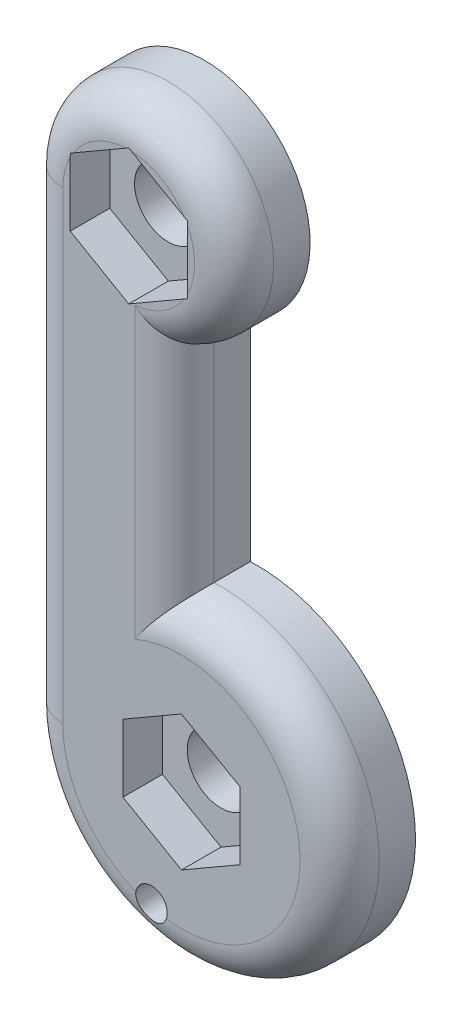
ISO-10303-21;
HEADER;
FILE_DESCRIPTION(('STEP AP214'),'2;1');
FILE_NAME('part.step','',(''),(''),'','','');
FILE_SCHEMA(('AUTOMOTIVE_DESIGN { 1 0 10303 214 1 1 1 1 }'));
ENDSEC;
DATA;
#1=APPLICATION_CONTEXT('core data for automotive mechanical design processes');
#2=APPLICATION_PROTOCOL_DEFINITION('international standard','automotive_design',2000,#1);
#3=PRODUCT_CONTEXT('',#1,'mechanical');
#4=PRODUCT('Part','Part','',(#3));
#5=PRODUCT_RELATED_PRODUCT_CATEGORY('part','',(#4));
#6=PRODUCT_DEFINITION_FORMATION('','',#4);
#7=PRODUCT_DEFINITION_CONTEXT('part definition',#1,'design');
#8=PRODUCT_DEFINITION('design','',#6,#7);
#9=PRODUCT_DEFINITION_SHAPE('','',#8);
#10=(LENGTH_UNIT() NAMED_UNIT(*) SI_UNIT(.MILLI.,.METRE.));
#11=(NAMED_UNIT(*) PLANE_ANGLE_UNIT() SI_UNIT($,.RADIAN.));
#12=(NAMED_UNIT(*) SI_UNIT($,.STERADIAN.) SOLID_ANGLE_UNIT());
#13=UNCERTAINTY_MEASURE_WITH_UNIT(LENGTH_MEASURE(1.E-05),#10,'distance_accuracy_value','');
#14=(GEOMETRIC_REPRESENTATION_CONTEXT(3) GLOBAL_UNCERTAINTY_ASSIGNED_CONTEXT((#13)) GLOBAL_UNIT_ASSIGNED_CONTEXT((#10,
#11,#12)) REPRESENTATION_CONTEXT('',''));
#15=CARTESIAN_POINT('',(0.,0.,0.));
#16=DIRECTION('',(0.,0.,1.));
#17=DIRECTION('',(1.,0.,0.));
#18=AXIS2_PLACEMENT_3D('',#15,#16,#17);
#19=CARTESIAN_POINT('',(-2.5,22.,3.6));
#20=DIRECTION('',(0.,0.,1.));
#21=DIRECTION('',(1.,0.,0.));
#22=AXIS2_PLACEMENT_3D('',#19,#20,#21);
#23=PLANE('',#22);
#24=DIRECTION('',(0.,1.,0.));
#25=VECTOR('',#24,1.);
#26=CARTESIAN_POINT('',(0.274999999999997,20.3978530029988,3.6));
#27=LINE('',#26,#25);
#28=CARTESIAN_POINT('',(0.274999999999997,20.56298921368,3.6));
#29=VERTEX_POINT('',#28);
#30=CARTESIAN_POINT('',(0.274999999999997,23.43701078632,3.6));
#31=VERTEX_POINT('',#30);
#32=EDGE_CURVE('E286',#29,#31,#27,.T.);
#33=ORIENTED_EDGE('',*,*,#32,.F.);
#34=CARTESIAN_POINT('',(-2.5,22.,3.6));
#35=DIRECTION('',(0.,0.,1.));
#36=DIRECTION('',(1.,0.,0.));
#37=AXIS2_PLACEMENT_3D('',#34,#35,#36);
#38=CIRCLE('',#37,3.125);
#39=EDGE_CURVE('E366',#29,#31,#38,.T.);
#40=ORIENTED_EDGE('',*,*,#39,.T.);
#41=EDGE_LOOP('',(#33,#40));
#42=FACE_BOUND('',#41,.T.);
#43=ADVANCED_FACE('F39',(#42),#23,.T.);
#44=DIRECTION('',(-0.866025403784439,0.5,0.));
#45=VECTOR('',#44,1.);
#46=CARTESIAN_POINT('',(0.274999999999997,23.6021469970012,3.6));
#47=LINE('',#46,#45);
#48=CARTESIAN_POINT('',(0.131987846465366,23.6847151023418,3.6));
#49=VERTEX_POINT('',#48);
#50=CARTESIAN_POINT('',(-2.35698784646537,25.1217258886618,3.6));
#51=VERTEX_POINT('',#50);
#52=EDGE_CURVE('E289',#49,#51,#47,.T.);
#53=ORIENTED_EDGE('',*,*,#52,.F.);
#54=CARTESIAN_POINT('',(-2.5,22.,3.6));
#55=DIRECTION('',(0.,0.,1.));
#56=DIRECTION('',(1.,0.,0.));
#57=AXIS2_PLACEMENT_3D('',#54,#55,#56);
#58=CIRCLE('',#57,3.125);
#59=EDGE_CURVE('E364',#49,#51,#58,.T.);
#60=ORIENTED_EDGE('',*,*,#59,.T.);
#61=EDGE_LOOP('',(#53,#60));
#62=FACE_BOUND('',#61,.T.);
#63=ADVANCED_FACE('F443',(#62),#23,.T.);
#64=DIRECTION('',(-0.866025403784439,-0.5,0.));
#65=VECTOR('',#64,1.);
#66=CARTESIAN_POINT('',(-2.5,25.2042939940024,3.6));
#67=LINE('',#66,#65);
#68=CARTESIAN_POINT('',(-2.64301215353463,25.1217258886618,3.6));
#69=VERTEX_POINT('',#68);
#70=CARTESIAN_POINT('',(-5.13198784646537,23.6847151023418,3.6));
#71=VERTEX_POINT('',#70);
#72=EDGE_CURVE('E292',#69,#71,#67,.T.);
#73=ORIENTED_EDGE('',*,*,#72,.F.);
#74=CARTESIAN_POINT('',(-2.5,22.,3.6));
#75=DIRECTION('',(0.,0.,1.));
#76=DIRECTION('',(1.,0.,0.));
#77=AXIS2_PLACEMENT_3D('',#74,#75,#76);
#78=CIRCLE('',#77,3.125);
#79=EDGE_CURVE('E362',#69,#71,#78,.T.);
#80=ORIENTED_EDGE('',*,*,#79,.T.);
#81=EDGE_LOOP('',(#73,#80));
#82=FACE_BOUND('',#81,.T.);
#83=ADVANCED_FACE('F451',(#82),#23,.T.);
#84=CARTESIAN_POINT('',(0.,0.,3.6));
#85=DIRECTION('',(0.,0.,-1.));
#86=DIRECTION('',(-1.,0.,0.));
#87=AXIS2_PLACEMENT_3D('',#84,#85,#86);
#88=CYLINDRICAL_SURFACE('',#87,1.6);
#89=CARTESIAN_POINT('',(0.,0.,0.));
#90=DIRECTION('',(0.,0.,1.));
#91=DIRECTION('',(1.,0.,0.));
#92=AXIS2_PLACEMENT_3D('',#89,#90,#91);
#93=CIRCLE('',#92,1.6);
#94=CARTESIAN_POINT('',(1.6,0.,0.));
#95=VERTEX_POINT('',#94);
#96=EDGE_CURVE('E322',#95,#95,#93,.T.);
#97=ORIENTED_EDGE('',*,*,#96,.F.);
#98=EDGE_LOOP('',(#97));
#99=FACE_BOUND('',#98,.T.);
#100=CARTESIAN_POINT('',(0.,0.,1.725));
#101=DIRECTION('',(0.,0.,1.));
#102=DIRECTION('',(1.,0.,0.));
#103=AXIS2_PLACEMENT_3D('',#100,#101,#102);
#104=CIRCLE('',#103,1.6);
#105=CARTESIAN_POINT('',(1.6,0.,1.725));
#106=VERTEX_POINT('',#105);
#107=EDGE_CURVE('E319',#106,#106,#104,.T.);
#108=ORIENTED_EDGE('',*,*,#107,.T.);
#109=EDGE_LOOP('',(#108));
#110=FACE_BOUND('',#109,.T.);
#111=ADVANCED_FACE('F466',(#99,#110),#88,.F.);
#112=CARTESIAN_POINT('',(-2.5,22.,3.6));
#113=DIRECTION('',(0.,0.,-1.));
#114=DIRECTION('',(-1.,0.,0.));
#115=AXIS2_PLACEMENT_3D('',#112,#113,#114);
#116=CYLINDRICAL_SURFACE('',#115,1.6);
#117=CARTESIAN_POINT('',(-2.5,22.,0.));
#118=DIRECTION('',(0.,0.,1.));
#119=DIRECTION('',(1.,0.,0.));
#120=AXIS2_PLACEMENT_3D('',#117,#118,#119);
#121=CIRCLE('',#120,1.6);
#122=CARTESIAN_POINT('',(-0.900000000000001,22.,0.));
#123=VERTEX_POINT('',#122);
#124=EDGE_CURVE('E315',#123,#123,#121,.T.);
#125=ORIENTED_EDGE('',*,*,#124,.F.);
#126=EDGE_LOOP('',(#125));
#127=FACE_BOUND('',#126,.T.);
#128=CARTESIAN_POINT('',(-2.5,22.,1.725));
#129=DIRECTION('',(0.,0.,1.));
#130=DIRECTION('',(1.,0.,0.));
#131=AXIS2_PLACEMENT_3D('',#128,#129,#130);
#132=CIRCLE('',#131,1.6);
#133=CARTESIAN_POINT('',(-0.900000000000001,22.,1.725));
#134=VERTEX_POINT('',#133);
#135=EDGE_CURVE('E253',#134,#134,#132,.T.);
#136=ORIENTED_EDGE('',*,*,#135,.T.);
#137=EDGE_LOOP('',(#136));
#138=FACE_BOUND('',#137,.T.);
#139=ADVANCED_FACE('F406',(#127,#138),#116,.F.);
#140=DIRECTION('',(-0.866025403784439,0.5,0.));
#141=VECTOR('',#140,1.);
#142=CARTESIAN_POINT('',(2.775,1.60214699700121,3.6));
#143=LINE('',#142,#141);
#144=CARTESIAN_POINT('',(2.775,1.60214699700121,3.6));
#145=VERTEX_POINT('',#144);
#146=CARTESIAN_POINT('',(0.,3.20429399400242,3.6));
#147=VERTEX_POINT('',#146);
#148=EDGE_CURVE('E208',#145,#147,#143,.T.);
#149=ORIENTED_EDGE('',*,*,#148,.F.);
#150=DIRECTION('',(0.,1.,0.));
#151=VECTOR('',#150,1.);
#152=CARTESIAN_POINT('',(2.775,-1.60214699700121,3.6));
#153=LINE('',#152,#151);
#154=CARTESIAN_POINT('',(2.775,-1.60214699700121,3.6));
#155=VERTEX_POINT('',#154);
#156=EDGE_CURVE('E226',#155,#145,#153,.T.);
#157=ORIENTED_EDGE('',*,*,#156,.F.);
#158=DIRECTION('',(0.866025403784439,0.5,0.));
#159=VECTOR('',#158,1.);
#160=CARTESIAN_POINT('',(0.,-3.20429399400242,3.6));
#161=LINE('',#160,#159);
#162=CARTESIAN_POINT('',(0.,-3.20429399400242,3.6));
#163=VERTEX_POINT('',#162);
#164=EDGE_CURVE('E229',#163,#155,#161,.T.);
#165=ORIENTED_EDGE('',*,*,#164,.F.);
#166=DIRECTION('',(0.866025403784439,-0.5,0.));
#167=VECTOR('',#166,1.);
#168=CARTESIAN_POINT('',(-2.775,-1.60214699700121,3.6));
#169=LINE('',#168,#167);
#170=CARTESIAN_POINT('',(-2.775,-1.60214699700121,3.6));
#171=VERTEX_POINT('',#170);
#172=EDGE_CURVE('E246',#171,#163,#169,.T.);
#173=ORIENTED_EDGE('',*,*,#172,.F.);
#174=DIRECTION('',(0.,-1.,0.));
#175=VECTOR('',#174,1.);
#176=CARTESIAN_POINT('',(-2.775,1.60214699700121,3.6));
#177=LINE('',#176,#175);
#178=CARTESIAN_POINT('',(-2.775,1.60214699700121,3.6));
#179=VERTEX_POINT('',#178);
#180=EDGE_CURVE('E243',#179,#171,#177,.T.);
#181=ORIENTED_EDGE('',*,*,#180,.F.);
#182=DIRECTION('',(-0.866025403784439,-0.5,0.));
#183=VECTOR('',#182,1.);
#184=CARTESIAN_POINT('',(0.,3.20429399400242,3.6));
#185=LINE('',#184,#183);
#186=EDGE_CURVE('E240',#147,#179,#185,.T.);
#187=ORIENTED_EDGE('',*,*,#186,.F.);
#188=EDGE_LOOP('',(#149,#157,#165,#173,#181,#187));
#189=FACE_BOUND('',#188,.T.);
#190=DIRECTION('',(0.,1.,0.));
#191=VECTOR('',#190,1.);
#192=CARTESIAN_POINT('',(-2.21118461577111,17.492461538381,3.6));
#193=LINE('',#192,#191);
#194=CARTESIAN_POINT('',(-2.21118461577111,5.17216469140119,3.6));
#195=VERTEX_POINT('',#194);
#196=CARTESIAN_POINT('',(-2.21118461577111,18.8883749143201,3.6));
#197=VERTEX_POINT('',#196);
#198=EDGE_CURVE('E355',#195,#197,#193,.T.);
#199=ORIENTED_EDGE('',*,*,#198,.T.);
#200=CARTESIAN_POINT('',(-2.5,22.,3.6));
#201=DIRECTION('',(0.,0.,1.));
#202=DIRECTION('',(1.,0.,0.));
#203=AXIS2_PLACEMENT_3D('',#200,#201,#202);
#204=CIRCLE('',#203,3.125);
#205=CARTESIAN_POINT('',(0.131987846465363,20.3152848976582,3.6));
#206=VERTEX_POINT('',#205);
#207=EDGE_CURVE('E359',#197,#206,#204,.T.);
#208=ORIENTED_EDGE('',*,*,#207,.T.);
#209=DIRECTION('',(0.866025403784439,0.5,0.));
#210=VECTOR('',#209,1.);
#211=CARTESIAN_POINT('',(-2.5,18.7957060059976,3.6));
#212=LINE('',#211,#210);
#213=CARTESIAN_POINT('',(-2.5,18.7957060059976,3.6));
#214=VERTEX_POINT('',#213);
#215=EDGE_CURVE('E283',#214,#206,#212,.T.);
#216=ORIENTED_EDGE('',*,*,#215,.F.);
#217=DIRECTION('',(0.866025403784439,-0.5,0.));
#218=VECTOR('',#217,1.);
#219=CARTESIAN_POINT('',(-5.275,20.3978530029988,3.6));
#220=LINE('',#219,#218);
#221=CARTESIAN_POINT('',(-5.275,20.3978530029988,3.6));
#222=VERTEX_POINT('',#221);
#223=EDGE_CURVE('E281',#222,#214,#220,.T.);
#224=ORIENTED_EDGE('',*,*,#223,.F.);
#225=DIRECTION('',(0.,-1.,0.));
#226=VECTOR('',#225,1.);
#227=CARTESIAN_POINT('',(-5.275,23.6021469970012,3.6));
#228=LINE('',#227,#226);
#229=CARTESIAN_POINT('',(-5.275,23.43701078632,3.6));
#230=VERTEX_POINT('',#229);
#231=EDGE_CURVE('E265',#230,#222,#228,.T.);
#232=ORIENTED_EDGE('',*,*,#231,.F.);
#233=CARTESIAN_POINT('',(-2.5,22.,3.6));
#234=DIRECTION('',(0.,0.,1.));
#235=DIRECTION('',(1.,0.,0.));
#236=AXIS2_PLACEMENT_3D('',#233,#234,#235);
#237=CIRCLE('',#236,3.125);
#238=CARTESIAN_POINT('',(-5.625,22.,3.6));
#239=VERTEX_POINT('',#238);
#240=EDGE_CURVE('E353',#230,#239,#237,.T.);
#241=ORIENTED_EDGE('',*,*,#240,.T.);
#242=DIRECTION('',(0.,-1.,0.));
#243=VECTOR('',#242,1.);
#244=CARTESIAN_POINT('',(-5.625,0.,3.6));
#245=LINE('',#244,#243);
#246=CARTESIAN_POINT('',(-5.625,0.,3.6));
#247=VERTEX_POINT('',#246);
#248=EDGE_CURVE('E345',#239,#247,#245,.T.);
#249=ORIENTED_EDGE('',*,*,#248,.T.);
#250=CARTESIAN_POINT('',(0.,0.,3.6));
#251=DIRECTION('',(0.,0.,1.));
#252=DIRECTION('',(1.,0.,0.));
#253=AXIS2_PLACEMENT_3D('',#250,#251,#252);
#254=CIRCLE('',#253,5.625);
#255=CARTESIAN_POINT('',(-2.16377511925431,-5.19217702253072,3.6));
#256=VERTEX_POINT('',#255);
#257=EDGE_CURVE('E351',#247,#256,#254,.T.);
#258=ORIENTED_EDGE('',*,*,#257,.T.);
#259=CARTESIAN_POINT('',(-1.42350474806383,-5.31259204458989,3.6));
#260=DIRECTION('',(0.,0.,1.));
#261=DIRECTION('',(1.,0.,0.));
#262=AXIS2_PLACEMENT_3D('',#259,#260,#261);
#263=CIRCLE('',#262,0.749999999999998);
#264=CARTESIAN_POINT('',(-0.722204289914353,-5.57844476208462,3.6));
#265=VERTEX_POINT('',#264);
#266=EDGE_CURVE('E316',#265,#256,#263,.T.);
#267=ORIENTED_EDGE('',*,*,#266,.F.);
#268=CARTESIAN_POINT('',(0.,0.,3.6));
#269=DIRECTION('',(0.,0.,1.));
#270=DIRECTION('',(1.,0.,0.));
#271=AXIS2_PLACEMENT_3D('',#268,#269,#270);
#272=CIRCLE('',#271,5.625);
#273=EDGE_CURVE('E357',#265,#195,#272,.T.);
#274=ORIENTED_EDGE('',*,*,#273,.T.);
#275=EDGE_LOOP('',(#199,#208,#216,#224,#232,#241,#249,#258,#267,#274));
#276=FACE_BOUND('',#275,.T.);
#277=ADVANCED_FACE('F446',(#189,#276),#23,.T.);
#278=CARTESIAN_POINT('',(-2.5,22.,0.));
#279=DIRECTION('',(0.,0.,1.));
#280=DIRECTION('',(1.,0.,0.));
#281=AXIS2_PLACEMENT_3D('',#278,#279,#280);
#282=PLANE('',#281);
#283=CARTESIAN_POINT('',(-1.42350474806383,-5.31259204458989,0.));
#284=DIRECTION('',(0.,0.,1.));
#285=DIRECTION('',(1.,0.,0.));
#286=AXIS2_PLACEMENT_3D('',#283,#284,#285);
#287=CIRCLE('',#286,0.749999999999998);
#288=CARTESIAN_POINT('',(-0.67350474806383,-5.31259204458989,0.));
#289=VERTEX_POINT('',#288);
#290=EDGE_CURVE('E312',#289,#289,#287,.T.);
#291=ORIENTED_EDGE('',*,*,#290,.T.);
#292=EDGE_LOOP('',(#291));
#293=FACE_BOUND('',#292,.T.);
#294=CARTESIAN_POINT('',(-2.5,22.,0.));
#295=DIRECTION('',(0.,0.,1.));
#296=DIRECTION('',(1.,0.,0.));
#297=AXIS2_PLACEMENT_3D('',#294,#295,#296);
#298=CIRCLE('',#297,5.);
#299=CARTESIAN_POINT('',(-0.336184615771112,17.492461538381,0.));
#300=VERTEX_POINT('',#299);
#301=CARTESIAN_POINT('',(-7.5,22.,0.));
#302=VERTEX_POINT('',#301);
#303=EDGE_CURVE('E325',#300,#302,#298,.T.);
#304=ORIENTED_EDGE('',*,*,#303,.F.);
#305=DIRECTION('',(0.,1.,0.));
#306=VECTOR('',#305,1.);
#307=CARTESIAN_POINT('',(-0.336184615771112,7.49246153838102,0.));
#308=LINE('',#307,#306);
#309=CARTESIAN_POINT('',(-0.336184615771113,7.49246153838102,0.));
#310=VERTEX_POINT('',#309);
#311=EDGE_CURVE('E334',#310,#300,#308,.T.);
#312=ORIENTED_EDGE('',*,*,#311,.F.);
#313=CARTESIAN_POINT('',(0.,0.,0.));
#314=DIRECTION('',(0.,0.,1.));
#315=DIRECTION('',(1.,0.,0.));
#316=AXIS2_PLACEMENT_3D('',#313,#314,#315);
#317=CIRCLE('',#316,7.5);
#318=CARTESIAN_POINT('',(-7.5,0.,0.));
#319=VERTEX_POINT('',#318);
#320=EDGE_CURVE('E331',#319,#310,#317,.T.);
#321=ORIENTED_EDGE('',*,*,#320,.F.);
#322=DIRECTION('',(0.,-1.,0.));
#323=VECTOR('',#322,1.);
#324=CARTESIAN_POINT('',(-7.5,22.,0.));
#325=LINE('',#324,#323);
#326=EDGE_CURVE('E328',#302,#319,#325,.T.);
#327=ORIENTED_EDGE('',*,*,#326,.F.);
#328=EDGE_LOOP('',(#304,#312,#321,#327));
#329=FACE_BOUND('',#328,.T.);
#330=ORIENTED_EDGE('',*,*,#96,.T.);
#331=EDGE_LOOP('',(#330));
#332=FACE_BOUND('',#331,.T.);
#333=ORIENTED_EDGE('',*,*,#124,.T.);
#334=EDGE_LOOP('',(#333));
#335=FACE_BOUND('',#334,.T.);
#336=ADVANCED_FACE('F456',(#293,#329,#332,#335),#282,.F.);
#337=CARTESIAN_POINT('',(-2.5,22.,3.6));
#338=DIRECTION('',(0.,0.,-1.));
#339=DIRECTION('',(-1.,0.,0.));
#340=AXIS2_PLACEMENT_3D('',#337,#338,#339);
#341=CYLINDRICAL_SURFACE('',#340,5.);
#342=DIRECTION('',(0.,0.,-1.));
#343=VECTOR('',#342,1.);
#344=CARTESIAN_POINT('',(-7.5,22.,3.6));
#345=LINE('',#344,#343);
#346=CARTESIAN_POINT('',(-7.5,22.,1.725));
#347=VERTEX_POINT('',#346);
#348=EDGE_CURVE('E343',#347,#302,#345,.T.);
#349=ORIENTED_EDGE('',*,*,#348,.F.);
#350=CARTESIAN_POINT('',(-2.5,22.,1.725));
#351=DIRECTION('',(0.,0.,1.));
#352=DIRECTION('',(1.,0.,0.));
#353=AXIS2_PLACEMENT_3D('',#350,#351,#352);
#354=CIRCLE('',#353,5.);
#355=CARTESIAN_POINT('',(-0.336184615771112,17.492461538381,1.725));
#356=VERTEX_POINT('',#355);
#357=EDGE_CURVE('E416',#347,#356,#354,.F.);
#358=ORIENTED_EDGE('',*,*,#357,.T.);
#359=DIRECTION('',(0.,0.,-1.));
#360=VECTOR('',#359,1.);
#361=CARTESIAN_POINT('',(-0.336184615771112,17.492461538381,3.6));
#362=LINE('',#361,#360);
#363=EDGE_CURVE('E337',#356,#300,#362,.T.);
#364=ORIENTED_EDGE('',*,*,#363,.T.);
#365=ORIENTED_EDGE('',*,*,#303,.T.);
#366=EDGE_LOOP('',(#349,#358,#364,#365));
#367=FACE_BOUND('',#366,.T.);
#368=ADVANCED_FACE('F463',(#367),#341,.T.);
#369=CARTESIAN_POINT('',(-7.5,22.,3.6));
#370=DIRECTION('',(1.,0.,0.));
#371=DIRECTION('',(0.,1.,0.));
#372=AXIS2_PLACEMENT_3D('',#369,#370,#371);
#373=PLANE('',#372);
#374=DIRECTION('',(0.,0.,-1.));
#375=VECTOR('',#374,1.);
#376=CARTESIAN_POINT('',(-7.5,0.,3.6));
#377=LINE('',#376,#375);
#378=CARTESIAN_POINT('',(-7.5,0.,1.725));
#379=VERTEX_POINT('',#378);
#380=EDGE_CURVE('E341',#379,#319,#377,.T.);
#381=ORIENTED_EDGE('',*,*,#380,.F.);
#382=DIRECTION('',(0.,-1.,0.));
#383=VECTOR('',#382,1.);
#384=CARTESIAN_POINT('',(-7.5,22.,1.725));
#385=LINE('',#384,#383);
#386=EDGE_CURVE('E11',#379,#347,#385,.F.);
#387=ORIENTED_EDGE('',*,*,#386,.T.);
#388=ORIENTED_EDGE('',*,*,#348,.T.);
#389=ORIENTED_EDGE('',*,*,#326,.T.);
#390=EDGE_LOOP('',(#381,#387,#388,#389));
#391=FACE_BOUND('',#390,.T.);
#392=ADVANCED_FACE('F569',(#391),#373,.F.);
#393=CARTESIAN_POINT('',(0.,0.,3.6));
#394=DIRECTION('',(0.,0.,-1.));
#395=DIRECTION('',(-1.,0.,0.));
#396=AXIS2_PLACEMENT_3D('',#393,#394,#395);
#397=CYLINDRICAL_SURFACE('',#396,7.5);
#398=DIRECTION('',(0.,0.,-1.));
#399=VECTOR('',#398,1.);
#400=CARTESIAN_POINT('',(-0.336184615771113,7.49246153838102,3.6));
#401=LINE('',#400,#399);
#402=CARTESIAN_POINT('',(-0.336184615771113,7.49246153838102,1.725));
#403=VERTEX_POINT('',#402);
#404=EDGE_CURVE('E339',#403,#310,#401,.T.);
#405=ORIENTED_EDGE('',*,*,#404,.F.);
#406=CARTESIAN_POINT('',(0.,0.,1.725));
#407=DIRECTION('',(0.,0.,1.));
#408=DIRECTION('',(1.,0.,0.));
#409=AXIS2_PLACEMENT_3D('',#406,#407,#408);
#410=CIRCLE('',#409,7.5);
#411=EDGE_CURVE('E62',#403,#379,#410,.F.);
#412=ORIENTED_EDGE('',*,*,#411,.T.);
#413=ORIENTED_EDGE('',*,*,#380,.T.);
#414=ORIENTED_EDGE('',*,*,#320,.T.);
#415=EDGE_LOOP('',(#405,#412,#413,#414));
#416=FACE_BOUND('',#415,.T.);
#417=ADVANCED_FACE('F570',(#416),#397,.T.);
#418=CARTESIAN_POINT('',(-0.336184615771112,7.49246153838102,3.6));
#419=DIRECTION('',(-1.,0.,0.));
#420=DIRECTION('',(0.,0.,1.));
#421=AXIS2_PLACEMENT_3D('',#418,#419,#420);
#422=PLANE('',#421);
#423=ORIENTED_EDGE('',*,*,#363,.F.);
#424=DIRECTION('',(0.,1.,0.));
#425=VECTOR('',#424,1.);
#426=CARTESIAN_POINT('',(-0.336184615771112,7.49246153838102,1.725));
#427=LINE('',#426,#425);
#428=EDGE_CURVE('E54',#356,#403,#427,.F.);
#429=ORIENTED_EDGE('',*,*,#428,.T.);
#430=ORIENTED_EDGE('',*,*,#404,.T.);
#431=ORIENTED_EDGE('',*,*,#311,.T.);
#432=EDGE_LOOP('',(#423,#429,#430,#431));
#433=FACE_BOUND('',#432,.T.);
#434=ADVANCED_FACE('F404',(#433),#422,.F.);
#435=CARTESIAN_POINT('',(-1.42350474806383,-5.31259204458989,0.));
#436=DIRECTION('',(0.,0.,1.));
#437=DIRECTION('',(1.,0.,0.));
#438=AXIS2_PLACEMENT_3D('',#435,#436,#437);
#439=CYLINDRICAL_SURFACE('',#438,0.749999999999998);
#440=ORIENTED_EDGE('',*,*,#290,.F.);
#441=EDGE_LOOP('',(#440));
#442=FACE_BOUND('',#441,.T.);
#443=ORIENTED_EDGE('',*,*,#266,.T.);
#444=CARTESIAN_POINT('',(-2.16377511925431,-5.19217702253072,3.6));
#445=CARTESIAN_POINT('',(-2.1704141921141,-5.23274992265785,3.60003021802474));
#446=CARTESIAN_POINT('',(-2.17363506128421,-5.27382918024728,3.59872025858216));
#447=CARTESIAN_POINT('',(-2.17336808780166,-5.35573080074242,3.59396714690995));
#448=CARTESIAN_POINT('',(-2.1698995332036,-5.39655356275782,3.59053014711849));
#449=CARTESIAN_POINT('',(-2.1564236251594,-5.4768866059409,3.58206752285162));
#450=CARTESIAN_POINT('',(-2.1464216165483,-5.51639793221783,3.57704319865496));
#451=CARTESIAN_POINT('',(-2.12021906109572,-5.59319023238629,3.5660668128601));
#452=CARTESIAN_POINT('',(-2.10401475148173,-5.63046983644313,3.56011418938877));
#453=CARTESIAN_POINT('',(-2.06513997408673,-5.70318734371822,3.54774872635346));
#454=CARTESIAN_POINT('',(-2.04225786416936,-5.73851074981872,3.54132703444238));
#455=CARTESIAN_POINT('',(-1.99086383469227,-5.8048987161232,3.52898022642289));
#456=CARTESIAN_POINT('',(-1.96235148360111,-5.83596294957226,3.5230551484272));
#457=CARTESIAN_POINT('',(-1.90000800549091,-5.89333374870423,3.51233431579353));
#458=CARTESIAN_POINT('',(-1.86611453800882,-5.9195756159933,3.5075536897586));
#459=CARTESIAN_POINT('',(-1.79420711276209,-5.96597482468258,3.49982373824116));
#460=CARTESIAN_POINT('',(-1.75619450688396,-5.98613415417923,3.49687381405414));
#461=CARTESIAN_POINT('',(-1.678665544302,-6.01906234816162,3.49325972701893));
#462=CARTESIAN_POINT('',(-1.63925797169088,-6.03207856842308,3.49251450108745));
#463=CARTESIAN_POINT('',(-1.55885716686691,-6.05143498558112,3.49317154539729));
#464=CARTESIAN_POINT('',(-1.51786414431454,-6.05777606209286,3.49457353263043));
#465=CARTESIAN_POINT('',(-1.43651867976537,-6.06356040308251,3.4992904822132));
#466=CARTESIAN_POINT('',(-1.39617487803455,-6.06316754201809,3.50255813081655));
#467=CARTESIAN_POINT('',(-1.31621782290825,-6.0559637747011,3.51059308521038));
#468=CARTESIAN_POINT('',(-1.27660469345358,-6.04915178962395,3.51536064299211));
#469=CARTESIAN_POINT('',(-1.19803402232859,-6.02907779305463,3.52601471631429));
#470=CARTESIAN_POINT('',(-1.15912395344415,-6.01564466070217,3.53192824201546));
#471=CARTESIAN_POINT('',(-1.08405695911592,-5.98263485201202,3.54412195666733));
#472=CARTESIAN_POINT('',(-1.04790086718471,-5.96305632483171,3.55040225561674));
#473=CARTESIAN_POINT('',(-0.977955428339915,-5.91740051394269,3.56284593408138));
#474=CARTESIAN_POINT('',(-0.944302479510294,-5.89111025041736,3.56899646700434));
#475=CARTESIAN_POINT('',(-0.881853292544048,-5.83309962367842,3.58013366052647));
#476=CARTESIAN_POINT('',(-0.853053595802054,-5.80138316013486,3.58512115093347));
#477=CARTESIAN_POINT('',(-0.805278704348446,-5.73872863234224,3.59255079329759));
#478=CARTESIAN_POINT('',(-0.785470447216373,-5.70845616374859,3.59527026584646));
#479=CARTESIAN_POINT('',(-0.750344342508642,-5.64526650814773,3.59900519117738));
#480=CARTESIAN_POINT('',(-0.735032224598846,-5.61234601406045,3.60001847739089));
#481=CARTESIAN_POINT('',(-0.722204289914352,-5.57844476208462,3.6));
#482=B_SPLINE_CURVE_WITH_KNOTS('',3,(#444,#445,#446,#447,#448,#449,#450,#451,#452,#453,#454,
#455,#456,#457,#458,#459,#460,#461,#462,#463,#464,#465,#466,#467,#468,#469,#470,#471,#472,#473,
#474,#475,#476,#477,#478,#479,#480,#481),.UNSPECIFIED.,.F.,.F.,(4,2,2,2,2,2,2,2,2,2,2,2,2,2,2,2,
2,2,4),(0.,0.123101424391631,0.245848432976401,0.36849515123128,0.491216394255297,
0.618352388682584,0.745498131269306,0.874241779245317,1.00294330125983,1.12684996411461,
1.25074029715966,1.3716200581208,1.49252013825969,1.61672301930441,1.74096334316985,
1.86978405515577,1.99851257295881,2.10694641926242,2.21551785468872),.UNSPECIFIED.);
#483=EDGE_CURVE('E409',#256,#265,#482,.T.);
#484=ORIENTED_EDGE('',*,*,#483,.T.);
#485=EDGE_LOOP('',(#443,#484));
#486=FACE_BOUND('',#485,.T.);
#487=ADVANCED_FACE('F399',(#442,#486),#439,.F.);
#488=CARTESIAN_POINT('',(-5.275,20.3978530029988,1.725));
#489=DIRECTION('',(-0.5,-0.866025403784439,0.));
#490=DIRECTION('',(0.866025403784439,-0.5,0.));
#491=AXIS2_PLACEMENT_3D('',#488,#489,#490);
#492=PLANE('',#491);
#493=ORIENTED_EDGE('',*,*,#223,.T.);
#494=DIRECTION('',(0.,0.,1.));
#495=VECTOR('',#494,1.);
#496=CARTESIAN_POINT('',(-2.5,18.7957060059976,1.725));
#497=LINE('',#496,#495);
#498=CARTESIAN_POINT('',(-2.5,18.7957060059976,1.725));
#499=VERTEX_POINT('',#498);
#500=EDGE_CURVE('E280',#499,#214,#497,.T.);
#501=ORIENTED_EDGE('',*,*,#500,.F.);
#502=DIRECTION('',(0.866025403784439,-0.5,0.));
#503=VECTOR('',#502,1.);
#504=CARTESIAN_POINT('',(-5.275,20.3978530029988,1.725));
#505=LINE('',#504,#503);
#506=CARTESIAN_POINT('',(-5.275,20.3978530029988,1.725));
#507=VERTEX_POINT('',#506);
#508=EDGE_CURVE('E261',#507,#499,#505,.T.);
#509=ORIENTED_EDGE('',*,*,#508,.F.);
#510=DIRECTION('',(0.,0.,1.));
#511=VECTOR('',#510,1.);
#512=CARTESIAN_POINT('',(-5.275,20.3978530029988,1.725));
#513=LINE('',#512,#511);
#514=EDGE_CURVE('E241',#507,#222,#513,.T.);
#515=ORIENTED_EDGE('',*,*,#514,.T.);
#516=EDGE_LOOP('',(#493,#501,#509,#515));
#517=FACE_BOUND('',#516,.T.);
#518=ADVANCED_FACE('F395',(#517),#492,.F.);
#519=CARTESIAN_POINT('',(-5.275,23.6021469970012,1.725));
#520=DIRECTION('',(-1.,0.,0.));
#521=DIRECTION('',(0.,0.,1.));
#522=AXIS2_PLACEMENT_3D('',#519,#520,#521);
#523=PLANE('',#522);
#524=DIRECTION('',(0.,0.,1.));
#525=VECTOR('',#524,1.);
#526=CARTESIAN_POINT('',(-5.275,23.6021469970012,1.725));
#527=LINE('',#526,#525);
#528=CARTESIAN_POINT('',(-5.275,23.6021469970012,1.725));
#529=VERTEX_POINT('',#528);
#530=CARTESIAN_POINT('',(-5.275,23.6021469970012,3.59832257300102));
#531=VERTEX_POINT('',#530);
#532=EDGE_CURVE('E298',#529,#531,#527,.T.);
#533=ORIENTED_EDGE('',*,*,#532,.T.);
#534=CARTESIAN_POINT('',(-5.275,23.6021469970012,3.59832257300102));
#535=CARTESIAN_POINT('',(-5.275,23.5746272226536,3.59889334537999));
#536=CARTESIAN_POINT('',(-5.275,23.5471059693194,3.59931851714627));
#537=CARTESIAN_POINT('',(-5.275,23.4920605657524,3.59987765883307));
#538=CARTESIAN_POINT('',(-5.275,23.4645364155263,3.60001162939978));
#539=CARTESIAN_POINT('',(-5.275,23.43701078632,3.6));
#540=B_SPLINE_CURVE_WITH_KNOTS('',3,(#534,#535,#536,#537,#538,#539),.UNSPECIFIED.,.F.,.F.,(4,2,
4),(0.,0.0825736120384716,0.165147040840064),.UNSPECIFIED.);
#541=EDGE_CURVE('E484',#531,#230,#540,.T.);
#542=ORIENTED_EDGE('',*,*,#541,.T.);
#543=ORIENTED_EDGE('',*,*,#231,.T.);
#544=ORIENTED_EDGE('',*,*,#514,.F.);
#545=DIRECTION('',(0.,-1.,0.));
#546=VECTOR('',#545,1.);
#547=CARTESIAN_POINT('',(-5.275,23.6021469970012,1.725));
#548=LINE('',#547,#546);
#549=EDGE_CURVE('E277',#529,#507,#548,.T.);
#550=ORIENTED_EDGE('',*,*,#549,.F.);
#551=EDGE_LOOP('',(#533,#542,#543,#544,#550));
#552=FACE_BOUND('',#551,.T.);
#553=ADVANCED_FACE('F398',(#552),#523,.F.);
#554=CARTESIAN_POINT('',(-2.5,25.2042939940024,1.725));
#555=DIRECTION('',(-0.5,0.866025403784439,0.));
#556=DIRECTION('',(-0.866025403784439,-0.5,0.));
#557=AXIS2_PLACEMENT_3D('',#554,#555,#556);
#558=PLANE('',#557);
#559=DIRECTION('',(0.,0.,1.));
#560=VECTOR('',#559,1.);
#561=CARTESIAN_POINT('',(-2.5,25.2042939940024,1.725));
#562=LINE('',#561,#560);
#563=CARTESIAN_POINT('',(-2.5,25.2042939940024,1.725));
#564=VERTEX_POINT('',#563);
#565=CARTESIAN_POINT('',(-2.5,25.2042939940024,3.59832257300102));
#566=VERTEX_POINT('',#565);
#567=EDGE_CURVE('E301',#564,#566,#562,.T.);
#568=ORIENTED_EDGE('',*,*,#567,.T.);
#569=CARTESIAN_POINT('',(-2.5,25.2042939940024,3.59832257300102));
#570=CARTESIAN_POINT('',(-2.52383282369142,25.1905341068286,3.59889334537999));
#571=CARTESIAN_POINT('',(-2.54766692822289,25.1767734801615,3.59931851714627));
#572=CARTESIAN_POINT('',(-2.59533764607345,25.149250778378,3.59987765883307));
#573=CARTESIAN_POINT('',(-2.61917425938686,25.1354887032649,3.60001162939978));
#574=CARTESIAN_POINT('',(-2.64301215353463,25.1217258886618,3.6));
#575=B_SPLINE_CURVE_WITH_KNOTS('',3,(#569,#570,#571,#572,#573,#574),.UNSPECIFIED.,.F.,.F.,(4,2,
4),(0.,0.0825736120384667,0.165147040840059),.UNSPECIFIED.);
#576=EDGE_CURVE('E480',#566,#69,#575,.T.);
#577=ORIENTED_EDGE('',*,*,#576,.T.);
#578=ORIENTED_EDGE('',*,*,#72,.T.);
#579=CARTESIAN_POINT('',(-5.13198784646537,23.6847151023418,3.6));
#580=CARTESIAN_POINT('',(-5.15582574061314,23.6709522877387,3.60001162939978));
#581=CARTESIAN_POINT('',(-5.17966235392655,23.6571902126256,3.59987765883307));
#582=CARTESIAN_POINT('',(-5.22733307177712,23.6296675108421,3.59931851714627));
#583=CARTESIAN_POINT('',(-5.25116717630858,23.615906884175,3.59889334537999));
#584=CARTESIAN_POINT('',(-5.275,23.6021469970012,3.59832257300102));
#585=B_SPLINE_CURVE_WITH_KNOTS('',3,(#579,#580,#581,#582,#583,#584),.UNSPECIFIED.,.F.,.F.,(4,2,
4),(0.,0.082573428801593,0.16514704084006),.UNSPECIFIED.);
#586=EDGE_CURVE('E482',#71,#531,#585,.T.);
#587=ORIENTED_EDGE('',*,*,#586,.T.);
#588=ORIENTED_EDGE('',*,*,#532,.F.);
#589=DIRECTION('',(-0.866025403784439,-0.5,0.));
#590=VECTOR('',#589,1.);
#591=CARTESIAN_POINT('',(-2.5,25.2042939940024,1.725));
#592=LINE('',#591,#590);
#593=EDGE_CURVE('E274',#564,#529,#592,.T.);
#594=ORIENTED_EDGE('',*,*,#593,.F.);
#595=EDGE_LOOP('',(#568,#577,#578,#587,#588,#594));
#596=FACE_BOUND('',#595,.T.);
#597=ADVANCED_FACE('F504',(#596),#558,.F.);
#598=CARTESIAN_POINT('',(0.274999999999997,23.6021469970012,1.725));
#599=DIRECTION('',(0.5,0.866025403784439,0.));
#600=DIRECTION('',(-0.866025403784439,0.5,0.));
#601=AXIS2_PLACEMENT_3D('',#598,#599,#600);
#602=PLANE('',#601);
#603=DIRECTION('',(0.,0.,1.));
#604=VECTOR('',#603,1.);
#605=CARTESIAN_POINT('',(0.274999999999997,23.6021469970012,1.725));
#606=LINE('',#605,#604);
#607=CARTESIAN_POINT('',(0.274999999999997,23.6021469970012,1.725));
#608=VERTEX_POINT('',#607);
#609=CARTESIAN_POINT('',(0.274999999999997,23.6021469970012,3.59832257300102));
#610=VERTEX_POINT('',#609);
#611=EDGE_CURVE('E304',#608,#610,#606,.T.);
#612=ORIENTED_EDGE('',*,*,#611,.T.);
#613=CARTESIAN_POINT('',(0.274999999999997,23.6021469970012,3.59832257300102));
#614=CARTESIAN_POINT('',(0.251167176308578,23.615906884175,3.59889334537999));
#615=CARTESIAN_POINT('',(0.227333071777113,23.6296675108421,3.59931851714627));
#616=CARTESIAN_POINT('',(0.179662353926552,23.6571902126256,3.59987765883307));
#617=CARTESIAN_POINT('',(0.15582574061314,23.6709522877387,3.60001162939978));
#618=CARTESIAN_POINT('',(0.131987846465368,23.6847151023418,3.6));
#619=B_SPLINE_CURVE_WITH_KNOTS('',3,(#613,#614,#615,#616,#617,#618),.UNSPECIFIED.,.F.,.F.,(4,2,
4),(0.,0.0825736120384675,0.165147040840061),.UNSPECIFIED.);
#620=EDGE_CURVE('E485',#610,#49,#619,.T.);
#621=ORIENTED_EDGE('',*,*,#620,.T.);
#622=ORIENTED_EDGE('',*,*,#52,.T.);
#623=CARTESIAN_POINT('',(-2.35698784646537,25.1217258886618,3.6));
#624=CARTESIAN_POINT('',(-2.38082574061315,25.1354887032649,3.60001162939978));
#625=CARTESIAN_POINT('',(-2.40466235392656,25.149250778378,3.59987765883307));
#626=CARTESIAN_POINT('',(-2.45233307177712,25.1767734801615,3.59931851714627));
#627=CARTESIAN_POINT('',(-2.47616717630858,25.1905341068286,3.59889334537999));
#628=CARTESIAN_POINT('',(-2.5,25.2042939940024,3.59832257300102));
#629=B_SPLINE_CURVE_WITH_KNOTS('',3,(#623,#624,#625,#626,#627,#628),.UNSPECIFIED.,.F.,.F.,(4,2,
4),(0.,0.0825734288015919,0.165147040840059),.UNSPECIFIED.);
#630=EDGE_CURVE('E488',#51,#566,#629,.T.);
#631=ORIENTED_EDGE('',*,*,#630,.T.);
#632=ORIENTED_EDGE('',*,*,#567,.F.);
#633=DIRECTION('',(-0.866025403784439,0.5,0.));
#634=VECTOR('',#633,1.);
#635=CARTESIAN_POINT('',(0.274999999999997,23.6021469970012,1.725));
#636=LINE('',#635,#634);
#637=EDGE_CURVE('E271',#608,#564,#636,.T.);
#638=ORIENTED_EDGE('',*,*,#637,.F.);
#639=EDGE_LOOP('',(#612,#621,#622,#631,#632,#638));
#640=FACE_BOUND('',#639,.T.);
#641=ADVANCED_FACE('F508',(#640),#602,.F.);
#642=CARTESIAN_POINT('',(0.274999999999997,20.3978530029988,1.725));
#643=DIRECTION('',(1.,0.,0.));
#644=DIRECTION('',(0.,1.,0.));
#645=AXIS2_PLACEMENT_3D('',#642,#643,#644);
#646=PLANE('',#645);
#647=DIRECTION('',(0.,0.,1.));
#648=VECTOR('',#647,1.);
#649=CARTESIAN_POINT('',(0.274999999999997,20.3978530029988,1.725));
#650=LINE('',#649,#648);
#651=CARTESIAN_POINT('',(0.274999999999997,20.3978530029988,1.725));
#652=VERTEX_POINT('',#651);
#653=CARTESIAN_POINT('',(0.274999999999997,20.3978530029988,3.59832257300101));
#654=VERTEX_POINT('',#653);
#655=EDGE_CURVE('E307',#652,#654,#650,.T.);
#656=ORIENTED_EDGE('',*,*,#655,.T.);
#657=CARTESIAN_POINT('',(0.274999999999997,20.3978530029988,3.59832257300101));
#658=CARTESIAN_POINT('',(0.274999999999997,20.4253727773464,3.59889334537999));
#659=CARTESIAN_POINT('',(0.274999999999997,20.4528940306806,3.59931851714627));
#660=CARTESIAN_POINT('',(0.274999999999997,20.5079394342476,3.59987765883307));
#661=CARTESIAN_POINT('',(0.274999999999997,20.5354635844737,3.60001162939978));
#662=CARTESIAN_POINT('',(0.274999999999997,20.56298921368,3.6));
#663=B_SPLINE_CURVE_WITH_KNOTS('',3,(#657,#658,#659,#660,#661,#662),.UNSPECIFIED.,.F.,.F.,(4,2,
4),(0.,0.0825736120384716,0.165147040840067),.UNSPECIFIED.);
#664=EDGE_CURVE('E520',#654,#29,#663,.T.);
#665=ORIENTED_EDGE('',*,*,#664,.T.);
#666=ORIENTED_EDGE('',*,*,#32,.T.);
#667=CARTESIAN_POINT('',(0.274999999999997,23.43701078632,3.6));
#668=CARTESIAN_POINT('',(0.274999999999997,23.4645364155263,3.60001162939978));
#669=CARTESIAN_POINT('',(0.274999999999997,23.4920605657524,3.59987765883307));
#670=CARTESIAN_POINT('',(0.274999999999997,23.5471059693194,3.59931851714627));
#671=CARTESIAN_POINT('',(0.274999999999997,23.5746272226536,3.59889334537999));
#672=CARTESIAN_POINT('',(0.274999999999997,23.6021469970012,3.59832257300102));
#673=B_SPLINE_CURVE_WITH_KNOTS('',3,(#667,#668,#669,#670,#671,#672),.UNSPECIFIED.,.F.,.F.,(4,2,
4),(0.,0.0825734288015919,0.165147040840064),.UNSPECIFIED.);
#674=EDGE_CURVE('E376',#31,#610,#673,.T.);
#675=ORIENTED_EDGE('',*,*,#674,.T.);
#676=ORIENTED_EDGE('',*,*,#611,.F.);
#677=DIRECTION('',(0.,1.,0.));
#678=VECTOR('',#677,1.);
#679=CARTESIAN_POINT('',(0.274999999999997,20.3978530029988,1.725));
#680=LINE('',#679,#678);
#681=EDGE_CURVE('E268',#652,#608,#680,.T.);
#682=ORIENTED_EDGE('',*,*,#681,.F.);
#683=EDGE_LOOP('',(#656,#665,#666,#675,#676,#682));
#684=FACE_BOUND('',#683,.T.);
#685=ADVANCED_FACE('F391',(#684),#646,.F.);
#686=CARTESIAN_POINT('',(-2.5,18.7957060059976,1.725));
#687=DIRECTION('',(0.499999999999999,-0.866025403784439,0.));
#688=DIRECTION('',(0.866025403784439,0.5,0.));
#689=AXIS2_PLACEMENT_3D('',#686,#687,#688);
#690=PLANE('',#689);
#691=ORIENTED_EDGE('',*,*,#215,.T.);
#692=CARTESIAN_POINT('',(0.131987846465362,20.3152848976582,3.6));
#693=CARTESIAN_POINT('',(0.155825740613135,20.3290477122613,3.60001162939978));
#694=CARTESIAN_POINT('',(0.179662353926547,20.3428097873744,3.59987765883307));
#695=CARTESIAN_POINT('',(0.22733307177711,20.3703324891579,3.59931851714627));
#696=CARTESIAN_POINT('',(0.251167176308577,20.384093115825,3.59889334537999));
#697=CARTESIAN_POINT('',(0.274999999999998,20.3978530029988,3.59832257300101));
#698=B_SPLINE_CURVE_WITH_KNOTS('',3,(#692,#693,#694,#695,#696,#697),.UNSPECIFIED.,.F.,.F.,(4,2,
4),(0.,0.0825734288015952,0.165147040840068),.UNSPECIFIED.);
#699=EDGE_CURVE('E368',#206,#654,#698,.T.);
#700=ORIENTED_EDGE('',*,*,#699,.T.);
#701=ORIENTED_EDGE('',*,*,#655,.F.);
#702=DIRECTION('',(0.866025403784439,0.5,0.));
#703=VECTOR('',#702,1.);
#704=CARTESIAN_POINT('',(-2.5,18.7957060059976,1.725));
#705=LINE('',#704,#703);
#706=EDGE_CURVE('E264',#499,#652,#705,.T.);
#707=ORIENTED_EDGE('',*,*,#706,.F.);
#708=ORIENTED_EDGE('',*,*,#500,.T.);
#709=EDGE_LOOP('',(#691,#700,#701,#707,#708));
#710=FACE_BOUND('',#709,.T.);
#711=ADVANCED_FACE('F386',(#710),#690,.F.);
#712=CARTESIAN_POINT('',(0.,0.,1.725));
#713=DIRECTION('',(0.,0.,1.));
#714=DIRECTION('',(1.,0.,0.));
#715=AXIS2_PLACEMENT_3D('',#712,#713,#714);
#716=PLANE('',#715);
#717=ORIENTED_EDGE('',*,*,#135,.F.);
#718=EDGE_LOOP('',(#717));
#719=FACE_BOUND('',#718,.T.);
#720=ORIENTED_EDGE('',*,*,#508,.T.);
#721=ORIENTED_EDGE('',*,*,#706,.T.);
#722=ORIENTED_EDGE('',*,*,#681,.T.);
#723=ORIENTED_EDGE('',*,*,#637,.T.);
#724=ORIENTED_EDGE('',*,*,#593,.T.);
#725=ORIENTED_EDGE('',*,*,#549,.T.);
#726=EDGE_LOOP('',(#720,#721,#722,#723,#724,#725));
#727=FACE_BOUND('',#726,.T.);
#728=ADVANCED_FACE('F390',(#719,#727),#716,.T.);
#729=CARTESIAN_POINT('',(2.775,1.60214699700121,1.725));
#730=DIRECTION('',(0.5,0.866025403784439,0.));
#731=DIRECTION('',(-0.866025403784439,0.5,0.));
#732=AXIS2_PLACEMENT_3D('',#729,#730,#731);
#733=PLANE('',#732);
#734=ORIENTED_EDGE('',*,*,#148,.T.);
#735=DIRECTION('',(0.,0.,1.));
#736=VECTOR('',#735,1.);
#737=CARTESIAN_POINT('',(0.,3.20429399400242,1.725));
#738=LINE('',#737,#736);
#739=CARTESIAN_POINT('',(0.,3.20429399400242,1.725));
#740=VERTEX_POINT('',#739);
#741=EDGE_CURVE('E201',#740,#147,#738,.T.);
#742=ORIENTED_EDGE('',*,*,#741,.F.);
#743=DIRECTION('',(-0.866025403784439,0.5,0.));
#744=VECTOR('',#743,1.);
#745=CARTESIAN_POINT('',(2.775,1.60214699700121,1.725));
#746=LINE('',#745,#744);
#747=CARTESIAN_POINT('',(2.775,1.60214699700121,1.725));
#748=VERTEX_POINT('',#747);
#749=EDGE_CURVE('E205',#748,#740,#746,.T.);
#750=ORIENTED_EDGE('',*,*,#749,.F.);
#751=DIRECTION('',(0.,0.,1.));
#752=VECTOR('',#751,1.);
#753=CARTESIAN_POINT('',(2.775,1.60214699700121,1.725));
#754=LINE('',#753,#752);
#755=EDGE_CURVE('E251',#748,#145,#754,.T.);
#756=ORIENTED_EDGE('',*,*,#755,.T.);
#757=EDGE_LOOP('',(#734,#742,#750,#756));
#758=FACE_BOUND('',#757,.T.);
#759=ADVANCED_FACE('F203',(#758),#733,.F.);
#760=CARTESIAN_POINT('',(2.775,-1.60214699700121,1.725));
#761=DIRECTION('',(1.,0.,0.));
#762=DIRECTION('',(0.,0.,-1.));
#763=AXIS2_PLACEMENT_3D('',#760,#761,#762);
#764=PLANE('',#763);
#765=ORIENTED_EDGE('',*,*,#156,.T.);
#766=ORIENTED_EDGE('',*,*,#755,.F.);
#767=DIRECTION('',(0.,1.,0.));
#768=VECTOR('',#767,1.);
#769=CARTESIAN_POINT('',(2.775,-1.60214699700121,1.725));
#770=LINE('',#769,#768);
#771=CARTESIAN_POINT('',(2.775,-1.60214699700121,1.725));
#772=VERTEX_POINT('',#771);
#773=EDGE_CURVE('E213',#772,#748,#770,.T.);
#774=ORIENTED_EDGE('',*,*,#773,.F.);
#775=DIRECTION('',(0.,0.,1.));
#776=VECTOR('',#775,1.);
#777=CARTESIAN_POINT('',(2.775,-1.60214699700121,1.725));
#778=LINE('',#777,#776);
#779=EDGE_CURVE('E254',#772,#155,#778,.T.);
#780=ORIENTED_EDGE('',*,*,#779,.T.);
#781=EDGE_LOOP('',(#765,#766,#774,#780));
#782=FACE_BOUND('',#781,.T.);
#783=ADVANCED_FACE('F644',(#782),#764,.F.);
#784=CARTESIAN_POINT('',(0.,-3.20429399400242,1.725));
#785=DIRECTION('',(0.5,-0.866025403784439,0.));
#786=DIRECTION('',(0.866025403784439,0.5,0.));
#787=AXIS2_PLACEMENT_3D('',#784,#785,#786);
#788=PLANE('',#787);
#789=ORIENTED_EDGE('',*,*,#164,.T.);
#790=ORIENTED_EDGE('',*,*,#779,.F.);
#791=DIRECTION('',(0.866025403784439,0.5,0.));
#792=VECTOR('',#791,1.);
#793=CARTESIAN_POINT('',(0.,-3.20429399400242,1.725));
#794=LINE('',#793,#792);
#795=CARTESIAN_POINT('',(0.,-3.20429399400242,1.725));
#796=VERTEX_POINT('',#795);
#797=EDGE_CURVE('E236',#796,#772,#794,.T.);
#798=ORIENTED_EDGE('',*,*,#797,.F.);
#799=DIRECTION('',(0.,0.,1.));
#800=VECTOR('',#799,1.);
#801=CARTESIAN_POINT('',(0.,-3.20429399400242,1.725));
#802=LINE('',#801,#800);
#803=EDGE_CURVE('E256',#796,#163,#802,.T.);
#804=ORIENTED_EDGE('',*,*,#803,.T.);
#805=EDGE_LOOP('',(#789,#790,#798,#804));
#806=FACE_BOUND('',#805,.T.);
#807=ADVANCED_FACE('F651',(#806),#788,.F.);
#808=CARTESIAN_POINT('',(-2.775,-1.60214699700121,1.725));
#809=DIRECTION('',(-0.5,-0.866025403784439,0.));
#810=DIRECTION('',(0.866025403784439,-0.5,0.));
#811=AXIS2_PLACEMENT_3D('',#808,#809,#810);
#812=PLANE('',#811);
#813=ORIENTED_EDGE('',*,*,#172,.T.);
#814=ORIENTED_EDGE('',*,*,#803,.F.);
#815=DIRECTION('',(0.866025403784439,-0.5,0.));
#816=VECTOR('',#815,1.);
#817=CARTESIAN_POINT('',(-2.775,-1.60214699700121,1.725));
#818=LINE('',#817,#816);
#819=CARTESIAN_POINT('',(-2.775,-1.60214699700121,1.725));
#820=VERTEX_POINT('',#819);
#821=EDGE_CURVE('E233',#820,#796,#818,.T.);
#822=ORIENTED_EDGE('',*,*,#821,.F.);
#823=DIRECTION('',(0.,0.,1.));
#824=VECTOR('',#823,1.);
#825=CARTESIAN_POINT('',(-2.775,-1.60214699700121,1.725));
#826=LINE('',#825,#824);
#827=EDGE_CURVE('E258',#820,#171,#826,.T.);
#828=ORIENTED_EDGE('',*,*,#827,.T.);
#829=EDGE_LOOP('',(#813,#814,#822,#828));
#830=FACE_BOUND('',#829,.T.);
#831=ADVANCED_FACE('F659',(#830),#812,.F.);
#832=CARTESIAN_POINT('',(-2.775,1.60214699700121,1.725));
#833=DIRECTION('',(-1.,0.,0.));
#834=DIRECTION('',(0.,0.,1.));
#835=AXIS2_PLACEMENT_3D('',#832,#833,#834);
#836=PLANE('',#835);
#837=ORIENTED_EDGE('',*,*,#180,.T.);
#838=ORIENTED_EDGE('',*,*,#827,.F.);
#839=DIRECTION('',(0.,-1.,0.));
#840=VECTOR('',#839,1.);
#841=CARTESIAN_POINT('',(-2.775,1.60214699700121,1.725));
#842=LINE('',#841,#840);
#843=CARTESIAN_POINT('',(-2.775,1.60214699700121,1.725));
#844=VERTEX_POINT('',#843);
#845=EDGE_CURVE('E221',#844,#820,#842,.T.);
#846=ORIENTED_EDGE('',*,*,#845,.F.);
#847=DIRECTION('',(0.,0.,1.));
#848=VECTOR('',#847,1.);
#849=CARTESIAN_POINT('',(-2.775,1.60214699700121,1.725));
#850=LINE('',#849,#848);
#851=EDGE_CURVE('E212',#844,#179,#850,.T.);
#852=ORIENTED_EDGE('',*,*,#851,.T.);
#853=EDGE_LOOP('',(#837,#838,#846,#852));
#854=FACE_BOUND('',#853,.T.);
#855=ADVANCED_FACE('F667',(#854),#836,.F.);
#856=CARTESIAN_POINT('',(0.,3.20429399400242,1.725));
#857=DIRECTION('',(-0.5,0.866025403784439,0.));
#858=DIRECTION('',(-0.866025403784439,-0.5,0.));
#859=AXIS2_PLACEMENT_3D('',#856,#857,#858);
#860=PLANE('',#859);
#861=ORIENTED_EDGE('',*,*,#186,.T.);
#862=ORIENTED_EDGE('',*,*,#851,.F.);
#863=DIRECTION('',(-0.866025403784439,-0.5,0.));
#864=VECTOR('',#863,1.);
#865=CARTESIAN_POINT('',(0.,3.20429399400242,1.725));
#866=LINE('',#865,#864);
#867=EDGE_CURVE('E216',#740,#844,#866,.T.);
#868=ORIENTED_EDGE('',*,*,#867,.F.);
#869=ORIENTED_EDGE('',*,*,#741,.T.);
#870=EDGE_LOOP('',(#861,#862,#868,#869));
#871=FACE_BOUND('',#870,.T.);
#872=ADVANCED_FACE('F217',(#871),#860,.F.);
#873=CARTESIAN_POINT('',(0.,0.,1.725));
#874=DIRECTION('',(0.,0.,1.));
#875=DIRECTION('',(1.,0.,0.));
#876=AXIS2_PLACEMENT_3D('',#873,#874,#875);
#877=PLANE('',#876);
#878=ORIENTED_EDGE('',*,*,#107,.F.);
#879=EDGE_LOOP('',(#878));
#880=FACE_BOUND('',#879,.T.);
#881=ORIENTED_EDGE('',*,*,#749,.T.);
#882=ORIENTED_EDGE('',*,*,#867,.T.);
#883=ORIENTED_EDGE('',*,*,#845,.T.);
#884=ORIENTED_EDGE('',*,*,#821,.T.);
#885=ORIENTED_EDGE('',*,*,#797,.T.);
#886=ORIENTED_EDGE('',*,*,#773,.T.);
#887=EDGE_LOOP('',(#881,#882,#883,#884,#885,#886));
#888=FACE_BOUND('',#887,.T.);
#889=ADVANCED_FACE('F223',(#880,#888),#877,.T.);
#890=CARTESIAN_POINT('',(0.,0.,1.725));
#891=DIRECTION('',(0.,0.,1.));
#892=DIRECTION('',(1.,0.,0.));
#893=AXIS2_PLACEMENT_3D('',#890,#891,#892);
#894=TOROIDAL_SURFACE('',#893,5.625,1.875);
#895=CARTESIAN_POINT('',(-5.625,0.,1.725));
#896=DIRECTION('',(0.,1.,0.));
#897=DIRECTION('',(0.,0.,1.));
#898=AXIS2_PLACEMENT_3D('',#895,#896,#897);
#899=CIRCLE('',#898,1.875);
#900=EDGE_CURVE('E428',#379,#247,#899,.T.);
#901=ORIENTED_EDGE('',*,*,#900,.F.);
#902=ORIENTED_EDGE('',*,*,#411,.F.);
#903=CARTESIAN_POINT('',(-0.336184615771113,7.49246153838102,1.725));
#904=CARTESIAN_POINT('',(-0.336174352931142,7.49247065250671,1.76600367585171));
#905=CARTESIAN_POINT('',(-0.337529316312137,7.49105511310597,1.80700000271545));
#906=CARTESIAN_POINT('',(-0.34289104113645,7.48544511852175,1.88859853029392));
#907=CARTESIAN_POINT('',(-0.346895877114066,7.48125268110161,1.92920099547885));
#908=CARTESIAN_POINT('',(-0.357435526035816,7.47020456356591,2.00936300387709));
#909=CARTESIAN_POINT('',(-0.363949331045095,7.46337099640233,2.04892836790025));
#910=CARTESIAN_POINT('',(-0.379364449902529,7.44716827193788,2.12705440886156));
#911=CARTESIAN_POINT('',(-0.388266068909477,7.43779879054987,2.16561495669428));
#912=CARTESIAN_POINT('',(-0.418253121030702,7.40616080526337,2.27918692272231));
#913=CARTESIAN_POINT('',(-0.442660206077667,7.3803217610309,2.35237553411115));
#914=CARTESIAN_POINT('',(-0.498751508986086,7.32052356602859,2.49241294232842));
#915=CARTESIAN_POINT('',(-0.530451111321924,7.28654724234035,2.55924790801858));
#916=CARTESIAN_POINT('',(-0.613008877281478,7.19730256270792,2.71065415580934));
#917=CARTESIAN_POINT('',(-0.666511452098775,7.13890365584591,2.79194058317248));
#918=CARTESIAN_POINT('',(-0.780670111710174,7.01247895646346,2.9407679988049));
#919=CARTESIAN_POINT('',(-0.841338846224546,6.94443609679575,3.00828408929283));
#920=CARTESIAN_POINT('',(-0.995180695572963,6.76902173115364,3.15785918192976));
#921=CARTESIAN_POINT('',(-1.09071712276092,6.65770944585477,3.23283605945202));
#922=CARTESIAN_POINT('',(-1.2849256666237,6.42507526428636,3.35936237085863));
#923=CARTESIAN_POINT('',(-1.38360369660908,6.30373371039527,3.41086444240482));
#924=CARTESIAN_POINT('',(-1.60654368640594,6.02099126004057,3.50497567302966));
#925=CARTESIAN_POINT('',(-1.73064399772545,5.85750649843332,3.5415956099674));
#926=CARTESIAN_POINT('',(-1.97326857683766,5.52339796004342,3.58893697373318));
#927=CARTESIAN_POINT('',(-2.09179950603471,5.35278319816917,3.5996901544093));
#928=CARTESIAN_POINT('',(-2.207867087235,5.17718915082746,3.59999779296128));
#929=CARTESIAN_POINT('',(-2.20952628774741,5.17467717908231,3.59999999282033));
#930=CARTESIAN_POINT('',(-2.21118461577111,5.17216469140119,3.6));
#931=B_SPLINE_CURVE_WITH_KNOTS('',3,(#903,#904,#905,#906,#907,#908,#909,#910,#911,#912,#913,
#914,#915,#916,#917,#918,#919,#920,#921,#922,#923,#924,#925,#926,#927,#928,#929,#930),
.UNSPECIFIED.,.F.,.F.,(4,2,2,2,2,2,2,2,2,2,2,2,2,4),(0.,0.12295224900816,0.245815255711398,
0.367671124741353,0.489542574181077,0.732420015970963,0.975814614504161,1.31439030207493,
1.6535728360068,2.14505260066022,2.63751962370239,3.26070619941056,3.88312736437014,
3.89215878070596),.UNSPECIFIED.);
#932=EDGE_CURVE('E44',#195,#403,#931,.F.);
#933=ORIENTED_EDGE('',*,*,#932,.F.);
#934=ORIENTED_EDGE('',*,*,#273,.F.);
#935=ORIENTED_EDGE('',*,*,#483,.F.);
#936=ORIENTED_EDGE('',*,*,#257,.F.);
#937=EDGE_LOOP('',(#901,#902,#933,#934,#935,#936));
#938=FACE_BOUND('',#937,.T.);
#939=ADVANCED_FACE('F41',(#938),#894,.T.);
#940=CARTESIAN_POINT('',(-2.21118461577111,22.,1.725));
#941=DIRECTION('',(0.,-1.,0.));
#942=DIRECTION('',(0.,0.,-1.));
#943=AXIS2_PLACEMENT_3D('',#940,#941,#942);
#944=CYLINDRICAL_SURFACE('',#943,1.875);
#945=ORIENTED_EDGE('',*,*,#932,.T.);
#946=ORIENTED_EDGE('',*,*,#428,.F.);
#947=CARTESIAN_POINT('',(-0.336184615771112,17.492461538381,1.725));
#948=CARTESIAN_POINT('',(-0.336176350860481,17.4924579939303,1.77160661496678));
#949=CARTESIAN_POINT('',(-0.337922146006248,17.493554849888,1.81820885208011));
#950=CARTESIAN_POINT('',(-0.344858824260696,17.4979217703893,1.91103949871384));
#951=CARTESIAN_POINT('',(-0.350048626175915,17.5011911529016,1.95726802094769));
#952=CARTESIAN_POINT('',(-0.363781756347222,17.5098575163699,2.04882516627497));
#953=CARTESIAN_POINT('',(-0.372311055005422,17.5152455968423,2.0941567312849));
#954=CARTESIAN_POINT('',(-0.392597389336655,17.5280932637536,2.1837808209213));
#955=CARTESIAN_POINT('',(-0.404354548469137,17.5355529294266,2.2280733057346));
#956=CARTESIAN_POINT('',(-0.444231536799072,17.5609335426466,2.35886149159024));
#957=CARTESIAN_POINT('',(-0.476981007363936,17.5818711468309,2.44342478902735));
#958=CARTESIAN_POINT('',(-0.553218230170296,17.6310858866994,2.60522550637968));
#959=CARTESIAN_POINT('',(-0.596713992976488,17.6593684983505,2.68245740155815));
#960=CARTESIAN_POINT('',(-0.694893040559346,17.7239892834567,2.83172406565103));
#961=CARTESIAN_POINT('',(-0.750013499251205,17.7606492555781,2.9033307335242));
#962=CARTESIAN_POINT('',(-0.867805992933407,17.8402004302476,3.0360468526188));
#963=CARTESIAN_POINT('',(-0.930480267501587,17.8830934815768,3.09715317757713));
#964=CARTESIAN_POINT('',(-1.07032397926858,17.9805128187905,3.21617740483815));
#965=CARTESIAN_POINT('',(-1.14830095782804,18.0358276897425,3.27249719099217));
#966=CARTESIAN_POINT('',(-1.30863986644501,18.152251038841,3.37118269264985));
#967=CARTESIAN_POINT('',(-1.39100538687895,18.2133642937182,3.41353677234043));
#968=CARTESIAN_POINT('',(-1.57267547870219,18.351757913457,3.49116869254259));
#969=CARTESIAN_POINT('',(-1.67237791058102,18.4299762625348,3.52383141993501));
#970=CARTESIAN_POINT('',(-1.87139726435191,18.5917530006285,3.57179232484275));
#971=CARTESIAN_POINT('',(-1.97071443525135,18.6753069599637,3.58710471379916));
#972=CARTESIAN_POINT('',(-2.11433589351532,18.8010657454935,3.59805910506996));
#973=CARTESIAN_POINT('',(-2.15975244346238,18.8415778825209,3.59983499238028));
#974=CARTESIAN_POINT('',(-2.20690757617213,18.8844783092322,3.59999634142405));
#975=CARTESIAN_POINT('',(-2.20904655427618,18.8864261146155,3.59999999838393));
#976=CARTESIAN_POINT('',(-2.21118461577111,18.8883749143201,3.6));
#977=B_SPLINE_CURVE_WITH_KNOTS('',3,(#947,#948,#949,#950,#951,#952,#953,#954,#955,#956,#957,
#958,#959,#960,#961,#962,#963,#964,#965,#966,#967,#968,#969,#970,#971,#972,#973,#974,#975,#976),
.UNSPECIFIED.,.F.,.F.,(4,2,2,2,2,2,2,2,2,2,2,2,2,2,4),(0.,0.139766914913068,0.279489972876423,
0.4186322306462,0.557779811081013,0.835602839364461,1.11363359229396,1.40502517549357,
1.69650336484611,2.02812415223913,2.36002054219307,2.75119793290355,3.14205468305648,
3.32462561236441,3.3333044668238),.UNSPECIFIED.);
#978=EDGE_CURVE('E423',#197,#356,#977,.F.);
#979=ORIENTED_EDGE('',*,*,#978,.F.);
#980=ORIENTED_EDGE('',*,*,#198,.F.);
#981=EDGE_LOOP('',(#945,#946,#979,#980));
#982=FACE_BOUND('',#981,.T.);
#983=ADVANCED_FACE('F429',(#982),#944,.T.);
#984=CARTESIAN_POINT('',(-5.625,22.,1.725));
#985=DIRECTION('',(0.,1.,0.));
#986=DIRECTION('',(-1.,0.,0.));
#987=AXIS2_PLACEMENT_3D('',#984,#985,#986);
#988=CYLINDRICAL_SURFACE('',#987,1.875);
#989=ORIENTED_EDGE('',*,*,#900,.T.);
#990=ORIENTED_EDGE('',*,*,#248,.F.);
#991=CARTESIAN_POINT('',(-5.625,22.,1.725));
#992=DIRECTION('',(0.,1.,0.));
#993=DIRECTION('',(0.,0.,1.));
#994=AXIS2_PLACEMENT_3D('',#991,#992,#993);
#995=CIRCLE('',#994,1.875);
#996=EDGE_CURVE('E420',#347,#239,#995,.T.);
#997=ORIENTED_EDGE('',*,*,#996,.F.);
#998=ORIENTED_EDGE('',*,*,#386,.F.);
#999=EDGE_LOOP('',(#989,#990,#997,#998));
#1000=FACE_BOUND('',#999,.T.);
#1001=ADVANCED_FACE('F432',(#1000),#988,.T.);
#1002=CARTESIAN_POINT('',(-2.5,22.,1.725));
#1003=DIRECTION('',(0.,0.,1.));
#1004=DIRECTION('',(1.,0.,0.));
#1005=AXIS2_PLACEMENT_3D('',#1002,#1003,#1004);
#1006=TOROIDAL_SURFACE('',#1005,3.125,1.875);
#1007=ORIENTED_EDGE('',*,*,#978,.T.);
#1008=ORIENTED_EDGE('',*,*,#357,.F.);
#1009=ORIENTED_EDGE('',*,*,#996,.T.);
#1010=ORIENTED_EDGE('',*,*,#240,.F.);
#1011=ORIENTED_EDGE('',*,*,#541,.F.);
#1012=ORIENTED_EDGE('',*,*,#586,.F.);
#1013=ORIENTED_EDGE('',*,*,#79,.F.);
#1014=ORIENTED_EDGE('',*,*,#576,.F.);
#1015=ORIENTED_EDGE('',*,*,#630,.F.);
#1016=ORIENTED_EDGE('',*,*,#59,.F.);
#1017=ORIENTED_EDGE('',*,*,#620,.F.);
#1018=ORIENTED_EDGE('',*,*,#674,.F.);
#1019=ORIENTED_EDGE('',*,*,#39,.F.);
#1020=ORIENTED_EDGE('',*,*,#664,.F.);
#1021=ORIENTED_EDGE('',*,*,#699,.F.);
#1022=ORIENTED_EDGE('',*,*,#207,.F.);
#1023=EDGE_LOOP('',(#1007,#1008,#1009,#1010,#1011,#1012,#1013,#1014,#1015,#1016,#1017,#1018,
#1019,#1020,#1021,#1022));
#1024=FACE_BOUND('',#1023,.T.);
#1025=ADVANCED_FACE('F383',(#1024),#1006,.T.);
#1026=CLOSED_SHELL('',(#43,#63,#83,#111,#139,#277,#336,#368,#392,#417,#434,#487,#518,#553,#597,
#641,#685,#711,#728,#759,#783,#807,#831,#855,#872,#889,#939,#983,#1001,#1025));
#1027=MANIFOLD_SOLID_BREP('B2',#1026);
#1028=ADVANCED_BREP_SHAPE_REPRESENTATION('',(#18,#1027),#14);
#1029=SHAPE_DEFINITION_REPRESENTATION(#9,#1028);
ENDSEC;
END-ISO-10303-21;
